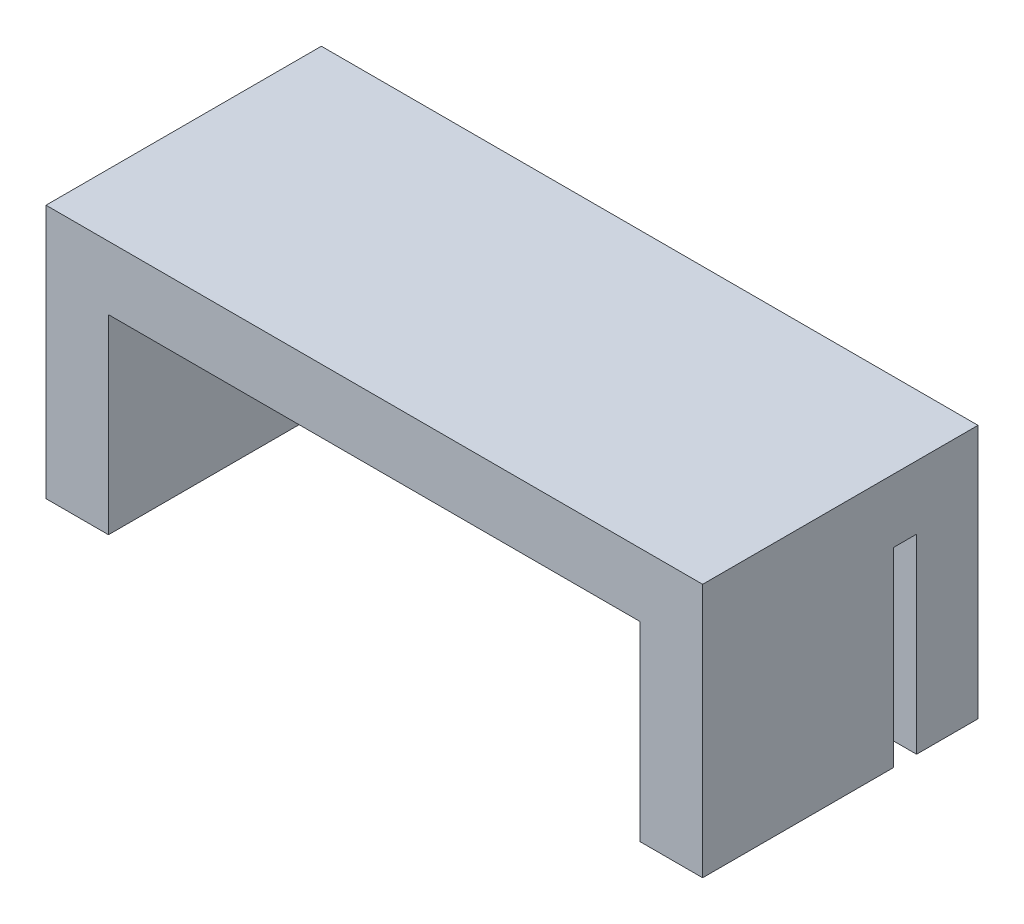
ISO-10303-21;
HEADER;
FILE_DESCRIPTION(('STEP AP214'),'2;1');
FILE_NAME('part.step','',(''),(''),'','','');
FILE_SCHEMA(('AUTOMOTIVE_DESIGN { 1 0 10303 214 1 1 1 1 }'));
ENDSEC;
DATA;
#1=APPLICATION_CONTEXT('core data for automotive mechanical design processes');
#2=APPLICATION_PROTOCOL_DEFINITION('international standard','automotive_design',2000,#1);
#3=PRODUCT_CONTEXT('',#1,'mechanical');
#4=PRODUCT('Part','Part','',(#3));
#5=PRODUCT_RELATED_PRODUCT_CATEGORY('part','',(#4));
#6=PRODUCT_DEFINITION_FORMATION('','',#4);
#7=PRODUCT_DEFINITION_CONTEXT('part definition',#1,'design');
#8=PRODUCT_DEFINITION('design','',#6,#7);
#9=PRODUCT_DEFINITION_SHAPE('','',#8);
#10=(LENGTH_UNIT() NAMED_UNIT(*) SI_UNIT(.MILLI.,.METRE.));
#11=(NAMED_UNIT(*) PLANE_ANGLE_UNIT() SI_UNIT($,.RADIAN.));
#12=(NAMED_UNIT(*) SI_UNIT($,.STERADIAN.) SOLID_ANGLE_UNIT());
#13=UNCERTAINTY_MEASURE_WITH_UNIT(LENGTH_MEASURE(1.E-05),#10,'distance_accuracy_value','');
#14=(GEOMETRIC_REPRESENTATION_CONTEXT(3) GLOBAL_UNCERTAINTY_ASSIGNED_CONTEXT((#13)) GLOBAL_UNIT_ASSIGNED_CONTEXT((#10,
#11,#12)) REPRESENTATION_CONTEXT('',''));
#15=CARTESIAN_POINT('',(0.,0.,0.));
#16=DIRECTION('',(0.,0.,1.));
#17=DIRECTION('',(1.,0.,0.));
#18=AXIS2_PLACEMENT_3D('',#15,#16,#17);
#19=CARTESIAN_POINT('',(-15.5,-6.,13.));
#20=DIRECTION('',(0.,1.,0.));
#21=DIRECTION('',(0.,0.,1.));
#22=AXIS2_PLACEMENT_3D('',#19,#20,#21);
#23=PLANE('',#22);
#24=DIRECTION('',(0.,0.,1.));
#25=VECTOR('',#24,1.);
#26=CARTESIAN_POINT('',(12.55,-6.,13.));
#27=LINE('',#26,#25);
#28=CARTESIAN_POINT('',(12.55,-6.,4.));
#29=VERTEX_POINT('',#28);
#30=CARTESIAN_POINT('',(12.55,-6.,13.));
#31=VERTEX_POINT('',#30);
#32=EDGE_CURVE('E171',#29,#31,#27,.T.);
#33=ORIENTED_EDGE('',*,*,#32,.F.);
#34=DIRECTION('',(-1.,0.,0.));
#35=VECTOR('',#34,1.);
#36=CARTESIAN_POINT('',(15.5,-6.,4.));
#37=LINE('',#36,#35);
#38=CARTESIAN_POINT('',(15.5,-6.,4.));
#39=VERTEX_POINT('',#38);
#40=EDGE_CURVE('E162',#39,#29,#37,.T.);
#41=ORIENTED_EDGE('',*,*,#40,.F.);
#42=DIRECTION('',(0.,0.,-1.));
#43=VECTOR('',#42,1.);
#44=CARTESIAN_POINT('',(15.5,-6.,13.));
#45=LINE('',#44,#43);
#46=CARTESIAN_POINT('',(15.5,-6.,13.));
#47=VERTEX_POINT('',#46);
#48=EDGE_CURVE('E146',#47,#39,#45,.T.);
#49=ORIENTED_EDGE('',*,*,#48,.F.);
#50=DIRECTION('',(1.,0.,0.));
#51=VECTOR('',#50,1.);
#52=CARTESIAN_POINT('',(-15.5,-6.,13.));
#53=LINE('',#52,#51);
#54=EDGE_CURVE('E195',#31,#47,#53,.T.);
#55=ORIENTED_EDGE('',*,*,#54,.F.);
#56=EDGE_LOOP('',(#33,#41,#49,#55));
#57=FACE_BOUND('',#56,.T.);
#58=ADVANCED_FACE('F34',(#57),#23,.F.);
#59=DIRECTION('',(0.,0.,-1.));
#60=VECTOR('',#59,1.);
#61=CARTESIAN_POINT('',(-15.5,-6.,13.));
#62=LINE('',#61,#60);
#63=CARTESIAN_POINT('',(-15.5,-6.,13.));
#64=VERTEX_POINT('',#63);
#65=CARTESIAN_POINT('',(-15.5,-6.,4.));
#66=VERTEX_POINT('',#65);
#67=EDGE_CURVE('E211',#64,#66,#62,.T.);
#68=ORIENTED_EDGE('',*,*,#67,.T.);
#69=CARTESIAN_POINT('',(-12.55,-6.,4.));
#70=VERTEX_POINT('',#69);
#71=EDGE_CURVE('E129',#70,#66,#37,.T.);
#72=ORIENTED_EDGE('',*,*,#71,.F.);
#73=DIRECTION('',(0.,0.,-1.));
#74=VECTOR('',#73,1.);
#75=CARTESIAN_POINT('',(-12.55,-6.,13.));
#76=LINE('',#75,#74);
#77=CARTESIAN_POINT('',(-12.55,-6.,13.));
#78=VERTEX_POINT('',#77);
#79=EDGE_CURVE('E168',#78,#70,#76,.T.);
#80=ORIENTED_EDGE('',*,*,#79,.F.);
#81=EDGE_CURVE('E196',#64,#78,#53,.T.);
#82=ORIENTED_EDGE('',*,*,#81,.F.);
#83=EDGE_LOOP('',(#68,#72,#80,#82));
#84=FACE_BOUND('',#83,.T.);
#85=ADVANCED_FACE('F270',(#84),#23,.F.);
#86=CARTESIAN_POINT('',(15.5,-6.,13.));
#87=DIRECTION('',(-1.,0.,0.));
#88=DIRECTION('',(0.,0.,1.));
#89=AXIS2_PLACEMENT_3D('',#86,#87,#88);
#90=PLANE('',#89);
#91=ORIENTED_EDGE('',*,*,#48,.T.);
#92=DIRECTION('',(0.,1.,0.));
#93=VECTOR('',#92,1.);
#94=CARTESIAN_POINT('',(15.5,-6.,4.));
#95=LINE('',#94,#93);
#96=CARTESIAN_POINT('',(15.5,3.,4.));
#97=VERTEX_POINT('',#96);
#98=EDGE_CURVE('E125',#39,#97,#95,.T.);
#99=ORIENTED_EDGE('',*,*,#98,.T.);
#100=DIRECTION('',(0.,0.,-1.));
#101=VECTOR('',#100,1.);
#102=CARTESIAN_POINT('',(15.5,3.,4.));
#103=LINE('',#102,#101);
#104=CARTESIAN_POINT('',(15.5,3.,2.9));
#105=VERTEX_POINT('',#104);
#106=EDGE_CURVE('E133',#97,#105,#103,.T.);
#107=ORIENTED_EDGE('',*,*,#106,.T.);
#108=DIRECTION('',(0.,-1.,0.));
#109=VECTOR('',#108,1.);
#110=CARTESIAN_POINT('',(15.5,-6.,2.9));
#111=LINE('',#110,#109);
#112=CARTESIAN_POINT('',(15.5,-6.,2.9));
#113=VERTEX_POINT('',#112);
#114=EDGE_CURVE('E141',#105,#113,#111,.T.);
#115=ORIENTED_EDGE('',*,*,#114,.T.);
#116=CARTESIAN_POINT('',(15.5,-6.,0.));
#117=VERTEX_POINT('',#116);
#118=EDGE_CURVE('E199',#113,#117,#45,.T.);
#119=ORIENTED_EDGE('',*,*,#118,.T.);
#120=DIRECTION('',(0.,1.,0.));
#121=VECTOR('',#120,1.);
#122=CARTESIAN_POINT('',(15.5,-6.,0.));
#123=LINE('',#122,#121);
#124=CARTESIAN_POINT('',(15.5,6.,0.));
#125=VERTEX_POINT('',#124);
#126=EDGE_CURVE('E184',#117,#125,#123,.T.);
#127=ORIENTED_EDGE('',*,*,#126,.T.);
#128=DIRECTION('',(0.,0.,-1.));
#129=VECTOR('',#128,1.);
#130=CARTESIAN_POINT('',(15.5,6.,13.));
#131=LINE('',#130,#129);
#132=CARTESIAN_POINT('',(15.5,6.,13.));
#133=VERTEX_POINT('',#132);
#134=EDGE_CURVE('E11',#133,#125,#131,.T.);
#135=ORIENTED_EDGE('',*,*,#134,.F.);
#136=DIRECTION('',(0.,1.,0.));
#137=VECTOR('',#136,1.);
#138=CARTESIAN_POINT('',(15.5,-6.,13.));
#139=LINE('',#138,#137);
#140=EDGE_CURVE('E187',#47,#133,#139,.T.);
#141=ORIENTED_EDGE('',*,*,#140,.F.);
#142=EDGE_LOOP('',(#91,#99,#107,#115,#119,#127,#135,#141));
#143=FACE_BOUND('',#142,.T.);
#144=ADVANCED_FACE('F36',(#143),#90,.F.);
#145=CARTESIAN_POINT('',(-15.5,6.,13.));
#146=DIRECTION('',(0.,-1.,0.));
#147=DIRECTION('',(0.,0.,-1.));
#148=AXIS2_PLACEMENT_3D('',#145,#146,#147);
#149=PLANE('',#148);
#150=DIRECTION('',(-1.,0.,0.));
#151=VECTOR('',#150,1.);
#152=CARTESIAN_POINT('',(-15.5,6.,0.));
#153=LINE('',#152,#151);
#154=CARTESIAN_POINT('',(-15.5,6.,0.));
#155=VERTEX_POINT('',#154);
#156=EDGE_CURVE('E202',#125,#155,#153,.T.);
#157=ORIENTED_EDGE('',*,*,#156,.T.);
#158=DIRECTION('',(0.,0.,-1.));
#159=VECTOR('',#158,1.);
#160=CARTESIAN_POINT('',(-15.5,6.,13.));
#161=LINE('',#160,#159);
#162=CARTESIAN_POINT('',(-15.5,6.,13.));
#163=VERTEX_POINT('',#162);
#164=EDGE_CURVE('E43',#163,#155,#161,.T.);
#165=ORIENTED_EDGE('',*,*,#164,.F.);
#166=DIRECTION('',(-1.,0.,0.));
#167=VECTOR('',#166,1.);
#168=CARTESIAN_POINT('',(-15.5,6.,13.));
#169=LINE('',#168,#167);
#170=EDGE_CURVE('E190',#133,#163,#169,.T.);
#171=ORIENTED_EDGE('',*,*,#170,.F.);
#172=ORIENTED_EDGE('',*,*,#134,.T.);
#173=EDGE_LOOP('',(#157,#165,#171,#172));
#174=FACE_BOUND('',#173,.T.);
#175=ADVANCED_FACE('F254',(#174),#149,.F.);
#176=CARTESIAN_POINT('',(-15.5,-6.,13.));
#177=DIRECTION('',(1.,0.,0.));
#178=DIRECTION('',(0.,0.,-1.));
#179=AXIS2_PLACEMENT_3D('',#176,#177,#178);
#180=PLANE('',#179);
#181=DIRECTION('',(0.,0.,-1.));
#182=VECTOR('',#181,1.);
#183=CARTESIAN_POINT('',(-15.5,3.,4.));
#184=LINE('',#183,#182);
#185=CARTESIAN_POINT('',(-15.5,3.,4.));
#186=VERTEX_POINT('',#185);
#187=CARTESIAN_POINT('',(-15.5,3.,2.9));
#188=VERTEX_POINT('',#187);
#189=EDGE_CURVE('E150',#186,#188,#184,.T.);
#190=ORIENTED_EDGE('',*,*,#189,.F.);
#191=DIRECTION('',(0.,1.,0.));
#192=VECTOR('',#191,1.);
#193=CARTESIAN_POINT('',(-15.5,-6.,4.));
#194=LINE('',#193,#192);
#195=EDGE_CURVE('E157',#66,#186,#194,.T.);
#196=ORIENTED_EDGE('',*,*,#195,.F.);
#197=ORIENTED_EDGE('',*,*,#67,.F.);
#198=DIRECTION('',(0.,-1.,0.));
#199=VECTOR('',#198,1.);
#200=CARTESIAN_POINT('',(-15.5,-6.,13.));
#201=LINE('',#200,#199);
#202=EDGE_CURVE('E193',#163,#64,#201,.T.);
#203=ORIENTED_EDGE('',*,*,#202,.F.);
#204=ORIENTED_EDGE('',*,*,#164,.T.);
#205=DIRECTION('',(0.,-1.,0.));
#206=VECTOR('',#205,1.);
#207=CARTESIAN_POINT('',(-15.5,-6.,0.));
#208=LINE('',#207,#206);
#209=CARTESIAN_POINT('',(-15.5,-6.,0.));
#210=VERTEX_POINT('',#209);
#211=EDGE_CURVE('E204',#155,#210,#208,.T.);
#212=ORIENTED_EDGE('',*,*,#211,.T.);
#213=CARTESIAN_POINT('',(-15.5,-6.,2.9));
#214=VERTEX_POINT('',#213);
#215=EDGE_CURVE('E210',#214,#210,#62,.T.);
#216=ORIENTED_EDGE('',*,*,#215,.F.);
#217=DIRECTION('',(0.,-1.,0.));
#218=VECTOR('',#217,1.);
#219=CARTESIAN_POINT('',(-15.5,-6.,2.9));
#220=LINE('',#219,#218);
#221=EDGE_CURVE('E147',#188,#214,#220,.T.);
#222=ORIENTED_EDGE('',*,*,#221,.F.);
#223=EDGE_LOOP('',(#190,#196,#197,#203,#204,#212,#216,#222));
#224=FACE_BOUND('',#223,.T.);
#225=ADVANCED_FACE('F249',(#224),#180,.F.);
#226=ORIENTED_EDGE('',*,*,#118,.F.);
#227=DIRECTION('',(1.,0.,0.));
#228=VECTOR('',#227,1.);
#229=CARTESIAN_POINT('',(-12.55,-6.,2.9));
#230=LINE('',#229,#228);
#231=EDGE_CURVE('E179',#214,#113,#230,.T.);
#232=ORIENTED_EDGE('',*,*,#231,.F.);
#233=ORIENTED_EDGE('',*,*,#215,.T.);
#234=DIRECTION('',(1.,0.,0.));
#235=VECTOR('',#234,1.);
#236=CARTESIAN_POINT('',(-15.5,-6.,0.));
#237=LINE('',#236,#235);
#238=EDGE_CURVE('E191',#210,#117,#237,.T.);
#239=ORIENTED_EDGE('',*,*,#238,.T.);
#240=EDGE_LOOP('',(#226,#232,#233,#239));
#241=FACE_BOUND('',#240,.T.);
#242=ADVANCED_FACE('F244',(#241),#23,.F.);
#243=CARTESIAN_POINT('',(0.,0.,13.));
#244=DIRECTION('',(0.,0.,-1.));
#245=DIRECTION('',(-1.,0.,0.));
#246=AXIS2_PLACEMENT_3D('',#243,#244,#245);
#247=PLANE('',#246);
#248=ORIENTED_EDGE('',*,*,#81,.T.);
#249=DIRECTION('',(0.,-1.,0.));
#250=VECTOR('',#249,1.);
#251=CARTESIAN_POINT('',(-12.55,3.,13.));
#252=LINE('',#251,#250);
#253=CARTESIAN_POINT('',(-12.55,3.,13.));
#254=VERTEX_POINT('',#253);
#255=EDGE_CURVE('E182',#254,#78,#252,.T.);
#256=ORIENTED_EDGE('',*,*,#255,.F.);
#257=DIRECTION('',(-1.,0.,0.));
#258=VECTOR('',#257,1.);
#259=CARTESIAN_POINT('',(-12.55,3.,13.));
#260=LINE('',#259,#258);
#261=CARTESIAN_POINT('',(12.55,3.,13.));
#262=VERTEX_POINT('',#261);
#263=EDGE_CURVE('E174',#262,#254,#260,.T.);
#264=ORIENTED_EDGE('',*,*,#263,.F.);
#265=DIRECTION('',(0.,-1.,0.));
#266=VECTOR('',#265,1.);
#267=CARTESIAN_POINT('',(12.55,3.,13.));
#268=LINE('',#267,#266);
#269=EDGE_CURVE('E176',#262,#31,#268,.T.);
#270=ORIENTED_EDGE('',*,*,#269,.T.);
#271=ORIENTED_EDGE('',*,*,#54,.T.);
#272=ORIENTED_EDGE('',*,*,#140,.T.);
#273=ORIENTED_EDGE('',*,*,#170,.T.);
#274=ORIENTED_EDGE('',*,*,#202,.T.);
#275=EDGE_LOOP('',(#248,#256,#264,#270,#271,#272,#273,#274));
#276=FACE_BOUND('',#275,.T.);
#277=ADVANCED_FACE('F235',(#276),#247,.F.);
#278=CARTESIAN_POINT('',(0.,0.,0.));
#279=DIRECTION('',(0.,0.,-1.));
#280=DIRECTION('',(-1.,0.,0.));
#281=AXIS2_PLACEMENT_3D('',#278,#279,#280);
#282=PLANE('',#281);
#283=CARTESIAN_POINT('',(-8.4125,-2.05,0.));
#284=DIRECTION('',(0.,0.,-1.));
#285=DIRECTION('',(-1.,0.,0.));
#286=AXIS2_PLACEMENT_3D('',#283,#284,#285);
#287=CIRCLE('',#286,1.5);
#288=CARTESIAN_POINT('',(-9.9125,-2.05,0.));
#289=VERTEX_POINT('',#288);
#290=EDGE_CURVE('E222',#289,#289,#287,.T.);
#291=ORIENTED_EDGE('',*,*,#290,.F.);
#292=EDGE_LOOP('',(#291));
#293=FACE_BOUND('',#292,.T.);
#294=CARTESIAN_POINT('',(8.4125,-2.05,0.));
#295=DIRECTION('',(0.,0.,-1.));
#296=DIRECTION('',(-1.,0.,0.));
#297=AXIS2_PLACEMENT_3D('',#294,#295,#296);
#298=CIRCLE('',#297,1.5);
#299=CARTESIAN_POINT('',(6.9125,-2.05,0.));
#300=VERTEX_POINT('',#299);
#301=EDGE_CURVE('E153',#300,#300,#298,.T.);
#302=ORIENTED_EDGE('',*,*,#301,.F.);
#303=EDGE_LOOP('',(#302));
#304=FACE_BOUND('',#303,.T.);
#305=ORIENTED_EDGE('',*,*,#126,.F.);
#306=ORIENTED_EDGE('',*,*,#238,.F.);
#307=ORIENTED_EDGE('',*,*,#211,.F.);
#308=ORIENTED_EDGE('',*,*,#156,.F.);
#309=EDGE_LOOP('',(#305,#306,#307,#308));
#310=FACE_BOUND('',#309,.T.);
#311=ADVANCED_FACE('F231',(#293,#304,#310),#282,.T.);
#312=CARTESIAN_POINT('',(-12.55,3.,13.));
#313=DIRECTION('',(-1.,0.,0.));
#314=DIRECTION('',(0.,0.,1.));
#315=AXIS2_PLACEMENT_3D('',#312,#313,#314);
#316=PLANE('',#315);
#317=ORIENTED_EDGE('',*,*,#79,.T.);
#318=DIRECTION('',(0.,1.,0.));
#319=VECTOR('',#318,1.);
#320=CARTESIAN_POINT('',(-12.55,3.,4.));
#321=LINE('',#320,#319);
#322=CARTESIAN_POINT('',(-12.55,3.,4.));
#323=VERTEX_POINT('',#322);
#324=EDGE_CURVE('E165',#70,#323,#321,.T.);
#325=ORIENTED_EDGE('',*,*,#324,.T.);
#326=DIRECTION('',(0.,0.,-1.));
#327=VECTOR('',#326,1.);
#328=CARTESIAN_POINT('',(-12.55,3.,13.));
#329=LINE('',#328,#327);
#330=EDGE_CURVE('E169',#254,#323,#329,.T.);
#331=ORIENTED_EDGE('',*,*,#330,.F.);
#332=ORIENTED_EDGE('',*,*,#255,.T.);
#333=EDGE_LOOP('',(#317,#325,#331,#332));
#334=FACE_BOUND('',#333,.T.);
#335=ADVANCED_FACE('F234',(#334),#316,.F.);
#336=CARTESIAN_POINT('',(12.55,3.,13.));
#337=DIRECTION('',(1.,0.,0.));
#338=DIRECTION('',(0.,0.,-1.));
#339=AXIS2_PLACEMENT_3D('',#336,#337,#338);
#340=PLANE('',#339);
#341=DIRECTION('',(0.,0.,1.));
#342=VECTOR('',#341,1.);
#343=CARTESIAN_POINT('',(12.55,3.,13.));
#344=LINE('',#343,#342);
#345=CARTESIAN_POINT('',(12.55,3.,4.));
#346=VERTEX_POINT('',#345);
#347=EDGE_CURVE('E56',#346,#262,#344,.T.);
#348=ORIENTED_EDGE('',*,*,#347,.F.);
#349=DIRECTION('',(0.,-1.,0.));
#350=VECTOR('',#349,1.);
#351=CARTESIAN_POINT('',(12.55,3.,4.));
#352=LINE('',#351,#350);
#353=EDGE_CURVE('E128',#346,#29,#352,.T.);
#354=ORIENTED_EDGE('',*,*,#353,.T.);
#355=ORIENTED_EDGE('',*,*,#32,.T.);
#356=ORIENTED_EDGE('',*,*,#269,.F.);
#357=EDGE_LOOP('',(#348,#354,#355,#356));
#358=FACE_BOUND('',#357,.T.);
#359=ADVANCED_FACE('F261',(#358),#340,.F.);
#360=CARTESIAN_POINT('',(-12.55,3.,2.9));
#361=DIRECTION('',(0.,0.,-1.));
#362=DIRECTION('',(-1.,0.,0.));
#363=AXIS2_PLACEMENT_3D('',#360,#361,#362);
#364=PLANE('',#363);
#365=CARTESIAN_POINT('',(-8.4125,-2.05,2.9));
#366=DIRECTION('',(0.,0.,-1.));
#367=DIRECTION('',(-1.,0.,0.));
#368=AXIS2_PLACEMENT_3D('',#365,#366,#367);
#369=CIRCLE('',#368,1.5);
#370=CARTESIAN_POINT('',(-9.9125,-2.05,2.9));
#371=VERTEX_POINT('',#370);
#372=EDGE_CURVE('E38',#371,#371,#369,.T.);
#373=ORIENTED_EDGE('',*,*,#372,.T.);
#374=EDGE_LOOP('',(#373));
#375=FACE_BOUND('',#374,.T.);
#376=CARTESIAN_POINT('',(8.4125,-2.05,2.9));
#377=DIRECTION('',(0.,0.,-1.));
#378=DIRECTION('',(-1.,0.,0.));
#379=AXIS2_PLACEMENT_3D('',#376,#377,#378);
#380=CIRCLE('',#379,1.5);
#381=CARTESIAN_POINT('',(6.9125,-2.05,2.9));
#382=VERTEX_POINT('',#381);
#383=EDGE_CURVE('E160',#382,#382,#380,.T.);
#384=ORIENTED_EDGE('',*,*,#383,.T.);
#385=EDGE_LOOP('',(#384));
#386=FACE_BOUND('',#385,.T.);
#387=ORIENTED_EDGE('',*,*,#231,.T.);
#388=ORIENTED_EDGE('',*,*,#114,.F.);
#389=DIRECTION('',(1.,0.,0.));
#390=VECTOR('',#389,1.);
#391=CARTESIAN_POINT('',(-12.55,3.,2.9));
#392=LINE('',#391,#390);
#393=EDGE_CURVE('E137',#188,#105,#392,.T.);
#394=ORIENTED_EDGE('',*,*,#393,.F.);
#395=ORIENTED_EDGE('',*,*,#221,.T.);
#396=EDGE_LOOP('',(#387,#388,#394,#395));
#397=FACE_BOUND('',#396,.T.);
#398=ADVANCED_FACE('F273',(#375,#386,#397),#364,.F.);
#399=CARTESIAN_POINT('',(0.,3.,0.));
#400=DIRECTION('',(0.,-1.,0.));
#401=DIRECTION('',(0.,0.,-1.));
#402=AXIS2_PLACEMENT_3D('',#399,#400,#401);
#403=PLANE('',#402);
#404=ORIENTED_EDGE('',*,*,#330,.T.);
#405=DIRECTION('',(-1.,0.,0.));
#406=VECTOR('',#405,1.);
#407=CARTESIAN_POINT('',(15.5,3.,4.));
#408=LINE('',#407,#406);
#409=EDGE_CURVE('E130',#323,#186,#408,.T.);
#410=ORIENTED_EDGE('',*,*,#409,.T.);
#411=ORIENTED_EDGE('',*,*,#189,.T.);
#412=ORIENTED_EDGE('',*,*,#393,.T.);
#413=ORIENTED_EDGE('',*,*,#106,.F.);
#414=EDGE_CURVE('E51',#97,#346,#408,.T.);
#415=ORIENTED_EDGE('',*,*,#414,.T.);
#416=ORIENTED_EDGE('',*,*,#347,.T.);
#417=ORIENTED_EDGE('',*,*,#263,.T.);
#418=EDGE_LOOP('',(#404,#410,#411,#412,#413,#415,#416,#417));
#419=FACE_BOUND('',#418,.T.);
#420=ADVANCED_FACE('F135',(#419),#403,.T.);
#421=CARTESIAN_POINT('',(15.5,-6.,4.));
#422=DIRECTION('',(0.,0.,1.));
#423=DIRECTION('',(1.,0.,0.));
#424=AXIS2_PLACEMENT_3D('',#421,#422,#423);
#425=PLANE('',#424);
#426=ORIENTED_EDGE('',*,*,#414,.F.);
#427=ORIENTED_EDGE('',*,*,#98,.F.);
#428=ORIENTED_EDGE('',*,*,#40,.T.);
#429=ORIENTED_EDGE('',*,*,#353,.F.);
#430=EDGE_LOOP('',(#426,#427,#428,#429));
#431=FACE_BOUND('',#430,.T.);
#432=ADVANCED_FACE('F123',(#431),#425,.F.);
#433=ORIENTED_EDGE('',*,*,#71,.T.);
#434=ORIENTED_EDGE('',*,*,#195,.T.);
#435=ORIENTED_EDGE('',*,*,#409,.F.);
#436=ORIENTED_EDGE('',*,*,#324,.F.);
#437=EDGE_LOOP('',(#433,#434,#435,#436));
#438=FACE_BOUND('',#437,.T.);
#439=ADVANCED_FACE('F267',(#438),#425,.F.);
#440=CARTESIAN_POINT('',(8.4125,-2.05,13.));
#441=DIRECTION('',(0.,0.,-1.));
#442=DIRECTION('',(-1.,0.,0.));
#443=AXIS2_PLACEMENT_3D('',#440,#441,#442);
#444=CYLINDRICAL_SURFACE('',#443,1.5);
#445=ORIENTED_EDGE('',*,*,#301,.T.);
#446=EDGE_LOOP('',(#445));
#447=FACE_BOUND('',#446,.T.);
#448=ORIENTED_EDGE('',*,*,#383,.F.);
#449=EDGE_LOOP('',(#448));
#450=FACE_BOUND('',#449,.T.);
#451=ADVANCED_FACE('F371',(#447,#450),#444,.F.);
#452=CARTESIAN_POINT('',(-8.4125,-2.05,13.));
#453=DIRECTION('',(0.,0.,-1.));
#454=DIRECTION('',(-1.,0.,0.));
#455=AXIS2_PLACEMENT_3D('',#452,#453,#454);
#456=CYLINDRICAL_SURFACE('',#455,1.5);
#457=ORIENTED_EDGE('',*,*,#290,.T.);
#458=EDGE_LOOP('',(#457));
#459=FACE_BOUND('',#458,.T.);
#460=ORIENTED_EDGE('',*,*,#372,.F.);
#461=EDGE_LOOP('',(#460));
#462=FACE_BOUND('',#461,.T.);
#463=ADVANCED_FACE('F228',(#459,#462),#456,.F.);
#464=CLOSED_SHELL('',(#58,#85,#144,#175,#225,#242,#277,#311,#335,#359,#398,#420,#432,#439,#451,#463));
#465=MANIFOLD_SOLID_BREP('B2',#464);
#466=ADVANCED_BREP_SHAPE_REPRESENTATION('',(#18,#465),#14);
#467=SHAPE_DEFINITION_REPRESENTATION(#9,#466);
ENDSEC;
END-ISO-10303-21;
